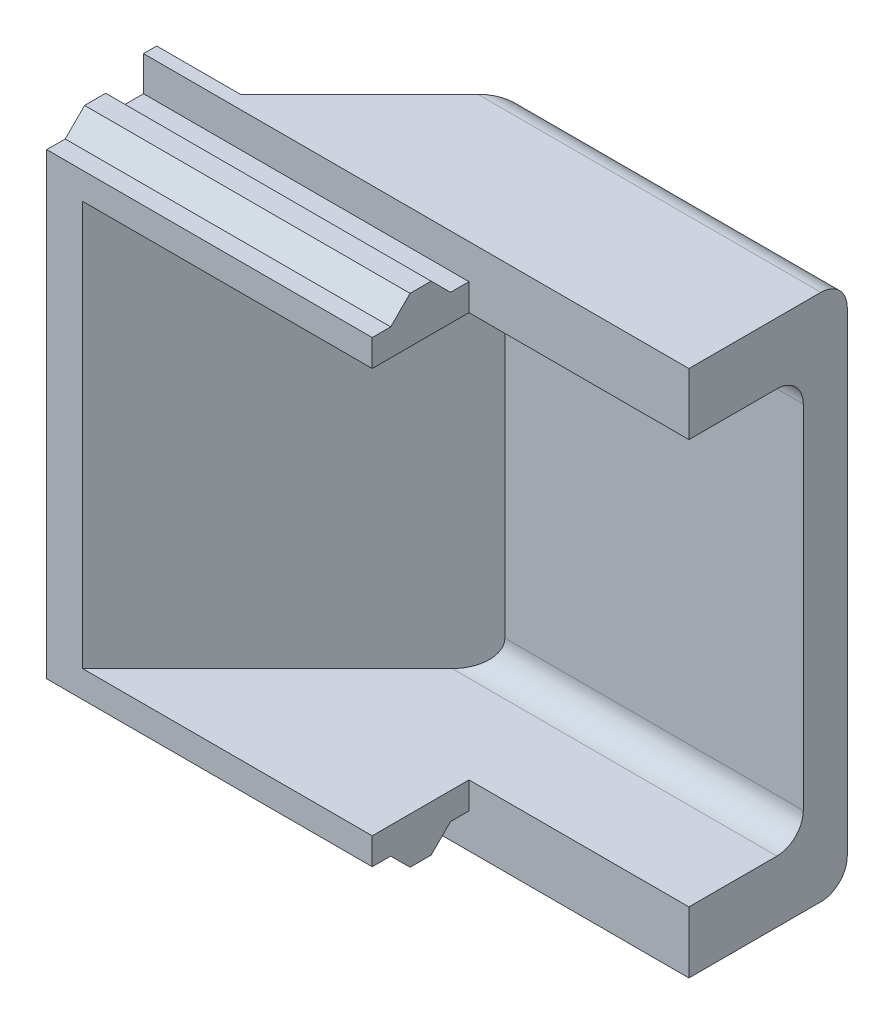
ISO-10303-21;
HEADER;
FILE_DESCRIPTION(('STEP AP214'),'2;1');
FILE_NAME('part.step','',(''),(''),'','','');
FILE_SCHEMA(('AUTOMOTIVE_DESIGN { 1 0 10303 214 1 1 1 1 }'));
ENDSEC;
DATA;
#1=APPLICATION_CONTEXT('core data for automotive mechanical design processes');
#2=APPLICATION_PROTOCOL_DEFINITION('international standard','automotive_design',2000,#1);
#3=PRODUCT_CONTEXT('',#1,'mechanical');
#4=PRODUCT('Part','Part','',(#3));
#5=PRODUCT_RELATED_PRODUCT_CATEGORY('part','',(#4));
#6=PRODUCT_DEFINITION_FORMATION('','',#4);
#7=PRODUCT_DEFINITION_CONTEXT('part definition',#1,'design');
#8=PRODUCT_DEFINITION('design','',#6,#7);
#9=PRODUCT_DEFINITION_SHAPE('','',#8);
#10=(LENGTH_UNIT() NAMED_UNIT(*) SI_UNIT(.MILLI.,.METRE.));
#11=(NAMED_UNIT(*) PLANE_ANGLE_UNIT() SI_UNIT($,.RADIAN.));
#12=(NAMED_UNIT(*) SI_UNIT($,.STERADIAN.) SOLID_ANGLE_UNIT());
#13=UNCERTAINTY_MEASURE_WITH_UNIT(LENGTH_MEASURE(1.E-05),#10,'distance_accuracy_value','');
#14=(GEOMETRIC_REPRESENTATION_CONTEXT(3) GLOBAL_UNCERTAINTY_ASSIGNED_CONTEXT((#13)) GLOBAL_UNIT_ASSIGNED_CONTEXT((#10,
#11,#12)) REPRESENTATION_CONTEXT('',''));
#15=CARTESIAN_POINT('',(0.,0.,0.));
#16=DIRECTION('',(0.,0.,1.));
#17=DIRECTION('',(1.,0.,0.));
#18=AXIS2_PLACEMENT_3D('',#15,#16,#17);
#19=CARTESIAN_POINT('',(9.398,-15.24,0.));
#20=DIRECTION('',(0.,0.,1.));
#21=DIRECTION('',(1.,0.,0.));
#22=AXIS2_PLACEMENT_3D('',#19,#20,#21);
#23=PLANE('',#22);
#24=DIRECTION('',(0.,1.,0.));
#25=VECTOR('',#24,1.);
#26=CARTESIAN_POINT('',(9.398,-15.24,0.));
#27=LINE('',#26,#25);
#28=CARTESIAN_POINT('',(9.398,-14.2367,0.));
#29=VERTEX_POINT('',#28);
#30=CARTESIAN_POINT('',(9.398,-13.462,0.));
#31=VERTEX_POINT('',#30);
#32=EDGE_CURVE('E364',#29,#31,#27,.T.);
#33=ORIENTED_EDGE('',*,*,#32,.T.);
#34=DIRECTION('',(1.,0.,0.));
#35=VECTOR('',#34,1.);
#36=CARTESIAN_POINT('',(1.03405122421385,-13.462,0.));
#37=LINE('',#36,#35);
#38=CARTESIAN_POINT('',(1.03405122421385,-13.462,0.));
#39=VERTEX_POINT('',#38);
#40=EDGE_CURVE('E342',#39,#31,#37,.T.);
#41=ORIENTED_EDGE('',*,*,#40,.F.);
#42=DIRECTION('',(0.,1.,0.));
#43=VECTOR('',#42,1.);
#44=CARTESIAN_POINT('',(1.03405122421385,-13.462,0.));
#45=LINE('',#44,#43);
#46=CARTESIAN_POINT('',(1.03405122421385,-1.778,0.));
#47=VERTEX_POINT('',#46);
#48=EDGE_CURVE('E350',#39,#47,#45,.T.);
#49=ORIENTED_EDGE('',*,*,#48,.T.);
#50=DIRECTION('',(1.,0.,0.));
#51=VECTOR('',#50,1.);
#52=CARTESIAN_POINT('',(1.03405122421385,-1.778,0.));
#53=LINE('',#52,#51);
#54=CARTESIAN_POINT('',(9.398,-1.778,0.));
#55=VERTEX_POINT('',#54);
#56=EDGE_CURVE('E375',#47,#55,#53,.T.);
#57=ORIENTED_EDGE('',*,*,#56,.T.);
#58=CARTESIAN_POINT('',(9.398,-1.0033,0.));
#59=VERTEX_POINT('',#58);
#60=EDGE_CURVE('E457',#55,#59,#27,.T.);
#61=ORIENTED_EDGE('',*,*,#60,.T.);
#62=DIRECTION('',(-1.,0.,0.));
#63=VECTOR('',#62,1.);
#64=CARTESIAN_POINT('',(15.748,-1.0033,0.));
#65=LINE('',#64,#63);
#66=CARTESIAN_POINT('',(0.,-1.0033,0.));
#67=VERTEX_POINT('',#66);
#68=EDGE_CURVE('E430',#59,#67,#65,.T.);
#69=ORIENTED_EDGE('',*,*,#68,.T.);
#70=DIRECTION('',(0.,1.,0.));
#71=VECTOR('',#70,1.);
#72=CARTESIAN_POINT('',(0.,-15.24,0.));
#73=LINE('',#72,#71);
#74=CARTESIAN_POINT('',(0.,-14.2367,0.));
#75=VERTEX_POINT('',#74);
#76=EDGE_CURVE('E469',#75,#67,#73,.T.);
#77=ORIENTED_EDGE('',*,*,#76,.F.);
#78=DIRECTION('',(-1.,0.,0.));
#79=VECTOR('',#78,1.);
#80=CARTESIAN_POINT('',(15.748,-14.2367,0.));
#81=LINE('',#80,#79);
#82=EDGE_CURVE('E399',#29,#75,#81,.T.);
#83=ORIENTED_EDGE('',*,*,#82,.F.);
#84=EDGE_LOOP('',(#33,#41,#49,#57,#61,#69,#77,#83));
#85=FACE_BOUND('',#84,.T.);
#86=ADVANCED_FACE('F149',(#85),#23,.T.);
#87=CARTESIAN_POINT('',(9.398,-15.24,-2.794));
#88=DIRECTION('',(1.,0.,0.));
#89=DIRECTION('',(0.,0.,-1.));
#90=AXIS2_PLACEMENT_3D('',#87,#88,#89);
#91=PLANE('',#90);
#92=DIRECTION('',(0.,1.,0.));
#93=VECTOR('',#92,1.);
#94=CARTESIAN_POINT('',(9.398,-15.24,-2.794));
#95=LINE('',#94,#93);
#96=CARTESIAN_POINT('',(9.398,-14.2367,-2.794));
#97=VERTEX_POINT('',#96);
#98=CARTESIAN_POINT('',(9.398,-13.462,-2.794));
#99=VERTEX_POINT('',#98);
#100=EDGE_CURVE('E486',#97,#99,#95,.T.);
#101=ORIENTED_EDGE('',*,*,#100,.T.);
#102=DIRECTION('',(0.,0.,1.));
#103=VECTOR('',#102,1.);
#104=CARTESIAN_POINT('',(9.398,-13.462,-2.794));
#105=LINE('',#104,#103);
#106=EDGE_CURVE('E379',#99,#31,#105,.T.);
#107=ORIENTED_EDGE('',*,*,#106,.T.);
#108=ORIENTED_EDGE('',*,*,#32,.F.);
#109=DIRECTION('',(0.,0.,-1.));
#110=VECTOR('',#109,1.);
#111=CARTESIAN_POINT('',(9.398,-14.2367,-2.794));
#112=LINE('',#111,#110);
#113=CARTESIAN_POINT('',(9.398,-14.2367,-0.533400000000003));
#114=VERTEX_POINT('',#113);
#115=EDGE_CURVE('E501',#29,#114,#112,.T.);
#116=ORIENTED_EDGE('',*,*,#115,.T.);
#117=DIRECTION('',(0.,-0.707106781186549,-0.707106781186546));
#118=VECTOR('',#117,1.);
#119=CARTESIAN_POINT('',(9.398,-15.86865,-2.16535));
#120=LINE('',#119,#118);
#121=CARTESIAN_POINT('',(9.398,-14.7955,-1.0922));
#122=VERTEX_POINT('',#121);
#123=EDGE_CURVE('E504',#114,#122,#120,.T.);
#124=ORIENTED_EDGE('',*,*,#123,.T.);
#125=DIRECTION('',(0.,0.,-1.));
#126=VECTOR('',#125,1.);
#127=CARTESIAN_POINT('',(9.398,-14.7955,-2.794));
#128=LINE('',#127,#126);
#129=CARTESIAN_POINT('',(9.398,-14.7955,-1.7018));
#130=VERTEX_POINT('',#129);
#131=EDGE_CURVE('E507',#122,#130,#128,.T.);
#132=ORIENTED_EDGE('',*,*,#131,.T.);
#133=DIRECTION('',(0.,0.707106781186549,-0.707106781186546));
#134=VECTOR('',#133,1.);
#135=CARTESIAN_POINT('',(9.398,-14.47165,-2.02565));
#136=LINE('',#135,#134);
#137=CARTESIAN_POINT('',(9.398,-14.2367,-2.2606));
#138=VERTEX_POINT('',#137);
#139=EDGE_CURVE('E510',#130,#138,#136,.T.);
#140=ORIENTED_EDGE('',*,*,#139,.T.);
#141=DIRECTION('',(0.,0.,-1.));
#142=VECTOR('',#141,1.);
#143=CARTESIAN_POINT('',(9.398,-14.2367,-2.794));
#144=LINE('',#143,#142);
#145=EDGE_CURVE('E513',#138,#97,#144,.T.);
#146=ORIENTED_EDGE('',*,*,#145,.T.);
#147=EDGE_LOOP('',(#101,#107,#108,#116,#124,#132,#140,#146));
#148=FACE_BOUND('',#147,.T.);
#149=ADVANCED_FACE('F587',(#148),#91,.T.);
#150=CARTESIAN_POINT('',(15.748,-15.24,-7.366));
#151=DIRECTION('',(1.,0.,0.));
#152=DIRECTION('',(0.,0.,-1.));
#153=AXIS2_PLACEMENT_3D('',#150,#151,#152);
#154=PLANE('',#153);
#155=DIRECTION('',(0.,0.,-1.));
#156=VECTOR('',#155,1.);
#157=CARTESIAN_POINT('',(15.748,-15.24,-7.366));
#158=LINE('',#157,#156);
#159=CARTESIAN_POINT('',(15.748,-15.24,-2.794));
#160=VERTEX_POINT('',#159);
#161=CARTESIAN_POINT('',(15.748,-15.24,-6.604));
#162=VERTEX_POINT('',#161);
#163=EDGE_CURVE('E446',#160,#162,#158,.T.);
#164=ORIENTED_EDGE('',*,*,#163,.T.);
#165=CARTESIAN_POINT('',(15.748,-14.478,-6.604));
#166=DIRECTION('',(1.,0.,0.));
#167=DIRECTION('',(0.,0.,-1.));
#168=AXIS2_PLACEMENT_3D('',#165,#166,#167);
#169=CIRCLE('',#168,0.762);
#170=CARTESIAN_POINT('',(15.748,-14.478,-7.366));
#171=VERTEX_POINT('',#170);
#172=EDGE_CURVE('E544',#162,#171,#169,.T.);
#173=ORIENTED_EDGE('',*,*,#172,.T.);
#174=DIRECTION('',(0.,1.,0.));
#175=VECTOR('',#174,1.);
#176=CARTESIAN_POINT('',(15.748,-15.24,-7.366));
#177=LINE('',#176,#175);
#178=CARTESIAN_POINT('',(15.748,-0.762000000000004,-7.366));
#179=VERTEX_POINT('',#178);
#180=EDGE_CURVE('E480',#171,#179,#177,.T.);
#181=ORIENTED_EDGE('',*,*,#180,.T.);
#182=CARTESIAN_POINT('',(15.748,-0.762,-6.604));
#183=DIRECTION('',(1.,0.,0.));
#184=DIRECTION('',(0.,0.,-1.));
#185=AXIS2_PLACEMENT_3D('',#182,#183,#184);
#186=CIRCLE('',#185,0.762);
#187=CARTESIAN_POINT('',(15.748,0.,-6.604));
#188=VERTEX_POINT('',#187);
#189=EDGE_CURVE('E164',#179,#188,#186,.T.);
#190=ORIENTED_EDGE('',*,*,#189,.T.);
#191=DIRECTION('',(0.,0.,-1.));
#192=VECTOR('',#191,1.);
#193=CARTESIAN_POINT('',(15.748,0.,-7.366));
#194=LINE('',#193,#192);
#195=CARTESIAN_POINT('',(15.748,0.,-2.794));
#196=VERTEX_POINT('',#195);
#197=EDGE_CURVE('E460',#196,#188,#194,.T.);
#198=ORIENTED_EDGE('',*,*,#197,.F.);
#199=DIRECTION('',(0.,1.,0.));
#200=VECTOR('',#199,1.);
#201=CARTESIAN_POINT('',(15.748,-15.24,-2.794));
#202=LINE('',#201,#200);
#203=CARTESIAN_POINT('',(15.748,-1.778,-2.794));
#204=VERTEX_POINT('',#203);
#205=EDGE_CURVE('E485',#204,#196,#202,.T.);
#206=ORIENTED_EDGE('',*,*,#205,.F.);
#207=DIRECTION('',(0.,0.,-1.));
#208=VECTOR('',#207,1.);
#209=CARTESIAN_POINT('',(15.748,-1.778,0.));
#210=LINE('',#209,#208);
#211=CARTESIAN_POINT('',(15.748,-1.778,-5.334));
#212=VERTEX_POINT('',#211);
#213=EDGE_CURVE('E371',#204,#212,#210,.T.);
#214=ORIENTED_EDGE('',*,*,#213,.T.);
#215=CARTESIAN_POINT('',(15.748,-2.54,-5.334));
#216=DIRECTION('',(1.,0.,0.));
#217=DIRECTION('',(0.,0.,-1.));
#218=AXIS2_PLACEMENT_3D('',#215,#216,#217);
#219=CIRCLE('',#218,0.762);
#220=CARTESIAN_POINT('',(15.748,-2.54,-6.096));
#221=VERTEX_POINT('',#220);
#222=EDGE_CURVE('E157',#212,#221,#219,.F.);
#223=ORIENTED_EDGE('',*,*,#222,.T.);
#224=DIRECTION('',(0.,1.,0.));
#225=VECTOR('',#224,1.);
#226=CARTESIAN_POINT('',(15.748,-13.462,-6.096));
#227=LINE('',#226,#225);
#228=CARTESIAN_POINT('',(15.748,-12.7,-6.096));
#229=VERTEX_POINT('',#228);
#230=EDGE_CURVE('E365',#229,#221,#227,.T.);
#231=ORIENTED_EDGE('',*,*,#230,.F.);
#232=CARTESIAN_POINT('',(15.748,-12.7,-5.334));
#233=DIRECTION('',(1.,0.,0.));
#234=DIRECTION('',(0.,0.,-1.));
#235=AXIS2_PLACEMENT_3D('',#232,#233,#234);
#236=CIRCLE('',#235,0.762);
#237=CARTESIAN_POINT('',(15.748,-13.462,-5.334));
#238=VERTEX_POINT('',#237);
#239=EDGE_CURVE('E12',#229,#238,#236,.F.);
#240=ORIENTED_EDGE('',*,*,#239,.T.);
#241=DIRECTION('',(0.,0.,-1.));
#242=VECTOR('',#241,1.);
#243=CARTESIAN_POINT('',(15.748,-13.462,0.));
#244=LINE('',#243,#242);
#245=CARTESIAN_POINT('',(15.748,-13.462,-2.794));
#246=VERTEX_POINT('',#245);
#247=EDGE_CURVE('E347',#246,#238,#244,.T.);
#248=ORIENTED_EDGE('',*,*,#247,.F.);
#249=EDGE_CURVE('E482',#160,#246,#202,.T.);
#250=ORIENTED_EDGE('',*,*,#249,.F.);
#251=EDGE_LOOP('',(#164,#173,#181,#190,#198,#206,#214,#223,#231,#240,#248,#250));
#252=FACE_BOUND('',#251,.T.);
#253=ADVANCED_FACE('F550',(#252),#154,.T.);
#254=CARTESIAN_POINT('',(15.748,-15.24,-2.794));
#255=DIRECTION('',(0.,0.,1.));
#256=DIRECTION('',(1.,0.,0.));
#257=AXIS2_PLACEMENT_3D('',#254,#255,#256);
#258=PLANE('',#257);
#259=ORIENTED_EDGE('',*,*,#249,.T.);
#260=DIRECTION('',(-1.,0.,0.));
#261=VECTOR('',#260,1.);
#262=CARTESIAN_POINT('',(15.748,-13.462,-2.794));
#263=LINE('',#262,#261);
#264=EDGE_CURVE('E518',#246,#99,#263,.T.);
#265=ORIENTED_EDGE('',*,*,#264,.T.);
#266=ORIENTED_EDGE('',*,*,#100,.F.);
#267=DIRECTION('',(-1.,0.,0.));
#268=VECTOR('',#267,1.);
#269=CARTESIAN_POINT('',(15.748,-14.2367,-2.794));
#270=LINE('',#269,#268);
#271=CARTESIAN_POINT('',(0.,-14.2367,-2.794));
#272=VERTEX_POINT('',#271);
#273=EDGE_CURVE('E400',#97,#272,#270,.T.);
#274=ORIENTED_EDGE('',*,*,#273,.T.);
#275=DIRECTION('',(0.,1.,0.));
#276=VECTOR('',#275,1.);
#277=CARTESIAN_POINT('',(0.,-15.24,-2.794));
#278=LINE('',#277,#276);
#279=CARTESIAN_POINT('',(0.,-15.24,-2.794));
#280=VERTEX_POINT('',#279);
#281=EDGE_CURVE('E396',#280,#272,#278,.T.);
#282=ORIENTED_EDGE('',*,*,#281,.F.);
#283=DIRECTION('',(1.,0.,0.));
#284=VECTOR('',#283,1.);
#285=CARTESIAN_POINT('',(15.748,-15.24,-2.794));
#286=LINE('',#285,#284);
#287=EDGE_CURVE('E443',#280,#160,#286,.T.);
#288=ORIENTED_EDGE('',*,*,#287,.T.);
#289=EDGE_LOOP('',(#259,#265,#266,#274,#282,#288));
#290=FACE_BOUND('',#289,.T.);
#291=ADVANCED_FACE('F591',(#290),#258,.T.);
#292=CARTESIAN_POINT('',(0.,-15.24,0.));
#293=DIRECTION('',(-1.,0.,0.));
#294=DIRECTION('',(0.,0.,1.));
#295=AXIS2_PLACEMENT_3D('',#292,#293,#294);
#296=PLANE('',#295);
#297=DIRECTION('',(0.,0.,1.));
#298=VECTOR('',#297,1.);
#299=CARTESIAN_POINT('',(0.,-15.24,0.));
#300=LINE('',#299,#298);
#301=CARTESIAN_POINT('',(0.,-15.24,-3.175));
#302=VERTEX_POINT('',#301);
#303=EDGE_CURVE('E454',#302,#280,#300,.T.);
#304=ORIENTED_EDGE('',*,*,#303,.T.);
#305=ORIENTED_EDGE('',*,*,#281,.T.);
#306=DIRECTION('',(0.,0.,1.));
#307=VECTOR('',#306,1.);
#308=CARTESIAN_POINT('',(0.,-14.2367,-2.794));
#309=LINE('',#308,#307);
#310=CARTESIAN_POINT('',(0.,-14.2367,-2.2606));
#311=VERTEX_POINT('',#310);
#312=EDGE_CURVE('E393',#272,#311,#309,.T.);
#313=ORIENTED_EDGE('',*,*,#312,.T.);
#314=DIRECTION('',(0.,-0.707106781186549,0.707106781186546));
#315=VECTOR('',#314,1.);
#316=CARTESIAN_POINT('',(0.,-14.7955,-1.7018));
#317=LINE('',#316,#315);
#318=CARTESIAN_POINT('',(0.,-14.7955,-1.7018));
#319=VERTEX_POINT('',#318);
#320=EDGE_CURVE('E390',#311,#319,#317,.T.);
#321=ORIENTED_EDGE('',*,*,#320,.T.);
#322=DIRECTION('',(0.,0.,1.));
#323=VECTOR('',#322,1.);
#324=CARTESIAN_POINT('',(0.,-14.7955,-1.0922));
#325=LINE('',#324,#323);
#326=CARTESIAN_POINT('',(0.,-14.7955,-1.0922));
#327=VERTEX_POINT('',#326);
#328=EDGE_CURVE('E387',#319,#327,#325,.T.);
#329=ORIENTED_EDGE('',*,*,#328,.T.);
#330=DIRECTION('',(0.,0.707106781186549,0.707106781186546));
#331=VECTOR('',#330,1.);
#332=CARTESIAN_POINT('',(0.,-14.2367,-0.533400000000003));
#333=LINE('',#332,#331);
#334=CARTESIAN_POINT('',(0.,-14.2367,-0.533400000000003));
#335=VERTEX_POINT('',#334);
#336=EDGE_CURVE('E384',#327,#335,#333,.T.);
#337=ORIENTED_EDGE('',*,*,#336,.T.);
#338=DIRECTION('',(0.,0.,1.));
#339=VECTOR('',#338,1.);
#340=CARTESIAN_POINT('',(0.,-14.2367,-0.533400000000003));
#341=LINE('',#340,#339);
#342=EDGE_CURVE('E381',#335,#75,#341,.T.);
#343=ORIENTED_EDGE('',*,*,#342,.T.);
#344=ORIENTED_EDGE('',*,*,#76,.T.);
#345=DIRECTION('',(0.,0.,1.));
#346=VECTOR('',#345,1.);
#347=CARTESIAN_POINT('',(0.,-1.0033,-0.533400000000003));
#348=LINE('',#347,#346);
#349=CARTESIAN_POINT('',(0.,-1.0033,-0.533400000000003));
#350=VERTEX_POINT('',#349);
#351=EDGE_CURVE('E426',#350,#67,#348,.T.);
#352=ORIENTED_EDGE('',*,*,#351,.F.);
#353=DIRECTION('',(0.,-0.707106781186549,0.707106781186546));
#354=VECTOR('',#353,1.);
#355=CARTESIAN_POINT('',(0.,-1.0033,-0.533400000000003));
#356=LINE('',#355,#354);
#357=CARTESIAN_POINT('',(0.,-0.4445,-1.0922));
#358=VERTEX_POINT('',#357);
#359=EDGE_CURVE('E423',#358,#350,#356,.T.);
#360=ORIENTED_EDGE('',*,*,#359,.F.);
#361=DIRECTION('',(0.,0.,1.));
#362=VECTOR('',#361,1.);
#363=CARTESIAN_POINT('',(0.,-0.4445,-1.0922));
#364=LINE('',#363,#362);
#365=CARTESIAN_POINT('',(0.,-0.444500000000001,-1.7018));
#366=VERTEX_POINT('',#365);
#367=EDGE_CURVE('E420',#366,#358,#364,.T.);
#368=ORIENTED_EDGE('',*,*,#367,.F.);
#369=DIRECTION('',(0.,0.707106781186549,0.707106781186546));
#370=VECTOR('',#369,1.);
#371=CARTESIAN_POINT('',(0.,-0.444500000000001,-1.7018));
#372=LINE('',#371,#370);
#373=CARTESIAN_POINT('',(0.,-1.0033,-2.2606));
#374=VERTEX_POINT('',#373);
#375=EDGE_CURVE('E417',#374,#366,#372,.T.);
#376=ORIENTED_EDGE('',*,*,#375,.F.);
#377=DIRECTION('',(0.,0.,1.));
#378=VECTOR('',#377,1.);
#379=CARTESIAN_POINT('',(0.,-1.0033,-2.794));
#380=LINE('',#379,#378);
#381=CARTESIAN_POINT('',(0.,-1.0033,-2.794));
#382=VERTEX_POINT('',#381);
#383=EDGE_CURVE('E414',#382,#374,#380,.T.);
#384=ORIENTED_EDGE('',*,*,#383,.F.);
#385=DIRECTION('',(0.,-1.,0.));
#386=VECTOR('',#385,1.);
#387=CARTESIAN_POINT('',(0.,0.,-2.794));
#388=LINE('',#387,#386);
#389=CARTESIAN_POINT('',(0.,0.,-2.794));
#390=VERTEX_POINT('',#389);
#391=EDGE_CURVE('E402',#390,#382,#388,.T.);
#392=ORIENTED_EDGE('',*,*,#391,.F.);
#393=DIRECTION('',(0.,0.,1.));
#394=VECTOR('',#393,1.);
#395=CARTESIAN_POINT('',(0.,0.,0.));
#396=LINE('',#395,#394);
#397=CARTESIAN_POINT('',(0.,0.,-3.175));
#398=VERTEX_POINT('',#397);
#399=EDGE_CURVE('E447',#398,#390,#396,.T.);
#400=ORIENTED_EDGE('',*,*,#399,.F.);
#401=DIRECTION('',(0.,1.,0.));
#402=VECTOR('',#401,1.);
#403=CARTESIAN_POINT('',(0.,-15.24,-3.175));
#404=LINE('',#403,#402);
#405=EDGE_CURVE('E472',#302,#398,#404,.T.);
#406=ORIENTED_EDGE('',*,*,#405,.F.);
#407=EDGE_LOOP('',(#304,#305,#313,#321,#329,#337,#343,#344,#352,#360,#368,#376,#384,#392,#400,#406));
#408=FACE_BOUND('',#407,.T.);
#409=ADVANCED_FACE('F582',(#408),#296,.T.);
#410=DIRECTION('',(0.,0.,1.));
#411=VECTOR('',#410,1.);
#412=CARTESIAN_POINT('',(9.398,-1.778,-2.794));
#413=LINE('',#412,#411);
#414=CARTESIAN_POINT('',(9.398,-1.778,-2.794));
#415=VERTEX_POINT('',#414);
#416=EDGE_CURVE('E358',#415,#55,#413,.T.);
#417=ORIENTED_EDGE('',*,*,#416,.F.);
#418=CARTESIAN_POINT('',(9.398,-1.0033,-2.794));
#419=VERTEX_POINT('',#418);
#420=EDGE_CURVE('E489',#415,#419,#95,.T.);
#421=ORIENTED_EDGE('',*,*,#420,.T.);
#422=DIRECTION('',(0.,0.,-1.));
#423=VECTOR('',#422,1.);
#424=CARTESIAN_POINT('',(9.398,-1.0033,-2.794));
#425=LINE('',#424,#423);
#426=CARTESIAN_POINT('',(9.398,-1.0033,-2.2606));
#427=VERTEX_POINT('',#426);
#428=EDGE_CURVE('E471',#427,#419,#425,.T.);
#429=ORIENTED_EDGE('',*,*,#428,.F.);
#430=DIRECTION('',(0.,-0.707106781186549,-0.707106781186546));
#431=VECTOR('',#430,1.);
#432=CARTESIAN_POINT('',(9.398,-8.38835000000003,-9.64565));
#433=LINE('',#432,#431);
#434=CARTESIAN_POINT('',(9.398,-0.444500000000001,-1.7018));
#435=VERTEX_POINT('',#434);
#436=EDGE_CURVE('E493',#435,#427,#433,.T.);
#437=ORIENTED_EDGE('',*,*,#436,.F.);
#438=DIRECTION('',(0.,0.,-1.));
#439=VECTOR('',#438,1.);
#440=CARTESIAN_POINT('',(9.398,-0.4445,-2.794));
#441=LINE('',#440,#439);
#442=CARTESIAN_POINT('',(9.398,-0.4445,-1.0922));
#443=VERTEX_POINT('',#442);
#444=EDGE_CURVE('E495',#443,#435,#441,.T.);
#445=ORIENTED_EDGE('',*,*,#444,.F.);
#446=DIRECTION('',(0.,0.707106781186549,-0.707106781186546));
#447=VECTOR('',#446,1.);
#448=CARTESIAN_POINT('',(9.398,-6.99135000000002,5.45465));
#449=LINE('',#448,#447);
#450=CARTESIAN_POINT('',(9.398,-1.0033,-0.533400000000003));
#451=VERTEX_POINT('',#450);
#452=EDGE_CURVE('E497',#451,#443,#449,.T.);
#453=ORIENTED_EDGE('',*,*,#452,.F.);
#454=DIRECTION('',(0.,0.,-1.));
#455=VECTOR('',#454,1.);
#456=CARTESIAN_POINT('',(9.398,-1.0033,-2.79400000000001));
#457=LINE('',#456,#455);
#458=EDGE_CURVE('E499',#59,#451,#457,.T.);
#459=ORIENTED_EDGE('',*,*,#458,.F.);
#460=ORIENTED_EDGE('',*,*,#60,.F.);
#461=EDGE_LOOP('',(#417,#421,#429,#437,#445,#453,#459,#460));
#462=FACE_BOUND('',#461,.T.);
#463=ADVANCED_FACE('F568',(#462),#91,.T.);
#464=CARTESIAN_POINT('',(0.,-15.24,0.));
#465=DIRECTION('',(0.,-1.,0.));
#466=DIRECTION('',(0.,0.,-1.));
#467=AXIS2_PLACEMENT_3D('',#464,#465,#466);
#468=PLANE('',#467);
#469=DIRECTION('',(-0.707106781186546,0.,0.707106781186549));
#470=VECTOR('',#469,1.);
#471=CARTESIAN_POINT('',(2.41300000000002,-15.24,-3.175));
#472=LINE('',#471,#470);
#473=CARTESIAN_POINT('',(5.842,-15.24,-6.604));
#474=VERTEX_POINT('',#473);
#475=CARTESIAN_POINT('',(2.41300000000002,-15.24,-3.175));
#476=VERTEX_POINT('',#475);
#477=EDGE_CURVE('E449',#474,#476,#472,.T.);
#478=ORIENTED_EDGE('',*,*,#477,.F.);
#479=DIRECTION('',(-1.,0.,0.));
#480=VECTOR('',#479,1.);
#481=CARTESIAN_POINT('',(0.,-15.24,-6.604));
#482=LINE('',#481,#480);
#483=EDGE_CURVE('E172',#474,#162,#482,.F.);
#484=ORIENTED_EDGE('',*,*,#483,.T.);
#485=ORIENTED_EDGE('',*,*,#163,.F.);
#486=ORIENTED_EDGE('',*,*,#287,.F.);
#487=ORIENTED_EDGE('',*,*,#303,.F.);
#488=DIRECTION('',(-1.,0.,0.));
#489=VECTOR('',#488,1.);
#490=CARTESIAN_POINT('',(0.,-15.24,-3.175));
#491=LINE('',#490,#489);
#492=EDGE_CURVE('E451',#476,#302,#491,.T.);
#493=ORIENTED_EDGE('',*,*,#492,.F.);
#494=EDGE_LOOP('',(#478,#484,#485,#486,#487,#493));
#495=FACE_BOUND('',#494,.T.);
#496=ADVANCED_FACE('F594',(#495),#468,.T.);
#497=CARTESIAN_POINT('',(0.,-15.24,-3.175));
#498=DIRECTION('',(0.,0.,-1.));
#499=DIRECTION('',(-1.,0.,0.));
#500=AXIS2_PLACEMENT_3D('',#497,#498,#499);
#501=PLANE('',#500);
#502=DIRECTION('',(-1.,0.,0.));
#503=VECTOR('',#502,1.);
#504=CARTESIAN_POINT('',(0.,0.,-3.175));
#505=LINE('',#504,#503);
#506=CARTESIAN_POINT('',(2.41300000000002,0.,-3.175));
#507=VERTEX_POINT('',#506);
#508=EDGE_CURVE('E464',#507,#398,#505,.T.);
#509=ORIENTED_EDGE('',*,*,#508,.F.);
#510=DIRECTION('',(0.,1.,0.));
#511=VECTOR('',#510,1.);
#512=CARTESIAN_POINT('',(2.41300000000002,-15.24,-3.175));
#513=LINE('',#512,#511);
#514=EDGE_CURVE('E474',#476,#507,#513,.T.);
#515=ORIENTED_EDGE('',*,*,#514,.F.);
#516=ORIENTED_EDGE('',*,*,#492,.T.);
#517=ORIENTED_EDGE('',*,*,#405,.T.);
#518=EDGE_LOOP('',(#509,#515,#516,#517));
#519=FACE_BOUND('',#518,.T.);
#520=ADVANCED_FACE('F603',(#519),#501,.T.);
#521=CARTESIAN_POINT('',(2.41300000000002,-15.24,-3.175));
#522=DIRECTION('',(-0.707106781186549,0.,-0.707106781186546));
#523=DIRECTION('',(-0.707106781186546,0.,0.707106781186549));
#524=AXIS2_PLACEMENT_3D('',#521,#522,#523);
#525=PLANE('',#524);
#526=DIRECTION('',(0.,1.,0.));
#527=VECTOR('',#526,1.);
#528=CARTESIAN_POINT('',(6.604,-15.24,-7.366));
#529=LINE('',#528,#527);
#530=CARTESIAN_POINT('',(6.604,-14.478,-7.366));
#531=VERTEX_POINT('',#530);
#532=CARTESIAN_POINT('',(6.604,-0.762000000000004,-7.366));
#533=VERTEX_POINT('',#532);
#534=EDGE_CURVE('E477',#531,#533,#529,.T.);
#535=ORIENTED_EDGE('',*,*,#534,.F.);
#536=CARTESIAN_POINT('',(5.842,-14.478,-6.604));
#537=DIRECTION('',(-0.707106781186549,0.,-0.707106781186546));
#538=DIRECTION('',(-0.707106781186546,0.,0.707106781186549));
#539=AXIS2_PLACEMENT_3D('',#536,#537,#538);
#540=ELLIPSE('',#539,1.0776307345283,0.762);
#541=EDGE_CURVE('E540',#531,#474,#540,.T.);
#542=ORIENTED_EDGE('',*,*,#541,.T.);
#543=ORIENTED_EDGE('',*,*,#477,.T.);
#544=ORIENTED_EDGE('',*,*,#514,.T.);
#545=DIRECTION('',(-0.707106781186546,0.,0.707106781186549));
#546=VECTOR('',#545,1.);
#547=CARTESIAN_POINT('',(2.41300000000002,0.,-3.175));
#548=LINE('',#547,#546);
#549=CARTESIAN_POINT('',(5.842,0.,-6.604));
#550=VERTEX_POINT('',#549);
#551=EDGE_CURVE('E462',#550,#507,#548,.T.);
#552=ORIENTED_EDGE('',*,*,#551,.F.);
#553=CARTESIAN_POINT('',(5.842,-0.762,-6.604));
#554=DIRECTION('',(-0.707106781186549,0.,-0.707106781186546));
#555=DIRECTION('',(0.707106781186546,0.,-0.707106781186549));
#556=AXIS2_PLACEMENT_3D('',#553,#554,#555);
#557=ELLIPSE('',#556,1.0776307345283,0.762);
#558=EDGE_CURVE('E538',#550,#533,#557,.T.);
#559=ORIENTED_EDGE('',*,*,#558,.T.);
#560=EDGE_LOOP('',(#535,#542,#543,#544,#552,#559));
#561=FACE_BOUND('',#560,.T.);
#562=ADVANCED_FACE('F618',(#561),#525,.T.);
#563=CARTESIAN_POINT('',(6.604,-15.24,-7.366));
#564=DIRECTION('',(0.,0.,-1.));
#565=DIRECTION('',(-1.,0.,0.));
#566=AXIS2_PLACEMENT_3D('',#563,#564,#565);
#567=PLANE('',#566);
#568=ORIENTED_EDGE('',*,*,#180,.F.);
#569=DIRECTION('',(-1.,0.,0.));
#570=VECTOR('',#569,1.);
#571=CARTESIAN_POINT('',(6.604,-14.478,-7.366));
#572=LINE('',#571,#570);
#573=EDGE_CURVE('E535',#171,#531,#572,.T.);
#574=ORIENTED_EDGE('',*,*,#573,.T.);
#575=ORIENTED_EDGE('',*,*,#534,.T.);
#576=DIRECTION('',(-1.,0.,0.));
#577=VECTOR('',#576,1.);
#578=CARTESIAN_POINT('',(15.748,-0.762,-7.366));
#579=LINE('',#578,#577);
#580=EDGE_CURVE('E533',#533,#179,#579,.F.);
#581=ORIENTED_EDGE('',*,*,#580,.T.);
#582=EDGE_LOOP('',(#568,#574,#575,#581));
#583=FACE_BOUND('',#582,.T.);
#584=ADVANCED_FACE('F610',(#583),#567,.T.);
#585=DIRECTION('',(-1.,0.,0.));
#586=VECTOR('',#585,1.);
#587=CARTESIAN_POINT('',(15.748,-1.778,-2.794));
#588=LINE('',#587,#586);
#589=EDGE_CURVE('E516',#204,#415,#588,.T.);
#590=ORIENTED_EDGE('',*,*,#589,.F.);
#591=ORIENTED_EDGE('',*,*,#205,.T.);
#592=DIRECTION('',(1.,0.,0.));
#593=VECTOR('',#592,1.);
#594=CARTESIAN_POINT('',(15.748,0.,-2.794));
#595=LINE('',#594,#593);
#596=EDGE_CURVE('E433',#390,#196,#595,.T.);
#597=ORIENTED_EDGE('',*,*,#596,.F.);
#598=ORIENTED_EDGE('',*,*,#391,.T.);
#599=DIRECTION('',(-1.,0.,0.));
#600=VECTOR('',#599,1.);
#601=CARTESIAN_POINT('',(15.748,-1.0033,-2.794));
#602=LINE('',#601,#600);
#603=EDGE_CURVE('E429',#419,#382,#602,.T.);
#604=ORIENTED_EDGE('',*,*,#603,.F.);
#605=ORIENTED_EDGE('',*,*,#420,.F.);
#606=EDGE_LOOP('',(#590,#591,#597,#598,#604,#605));
#607=FACE_BOUND('',#606,.T.);
#608=ADVANCED_FACE('F621',(#607),#258,.T.);
#609=CARTESIAN_POINT('',(0.,0.,0.));
#610=DIRECTION('',(0.,-1.,0.));
#611=DIRECTION('',(0.,0.,-1.));
#612=AXIS2_PLACEMENT_3D('',#609,#610,#611);
#613=PLANE('',#612);
#614=ORIENTED_EDGE('',*,*,#197,.T.);
#615=DIRECTION('',(-1.,0.,0.));
#616=VECTOR('',#615,1.);
#617=CARTESIAN_POINT('',(6.604,0.,-6.604));
#618=LINE('',#617,#616);
#619=EDGE_CURVE('E546',#188,#550,#618,.T.);
#620=ORIENTED_EDGE('',*,*,#619,.T.);
#621=ORIENTED_EDGE('',*,*,#551,.T.);
#622=ORIENTED_EDGE('',*,*,#508,.T.);
#623=ORIENTED_EDGE('',*,*,#399,.T.);
#624=ORIENTED_EDGE('',*,*,#596,.T.);
#625=EDGE_LOOP('',(#614,#620,#621,#622,#623,#624));
#626=FACE_BOUND('',#625,.T.);
#627=ADVANCED_FACE('F617',(#626),#613,.F.);
#628=CARTESIAN_POINT('',(15.748,-1.0033,-0.533400000000003));
#629=DIRECTION('',(0.,-1.,0.));
#630=DIRECTION('',(0.,0.,-1.));
#631=AXIS2_PLACEMENT_3D('',#628,#629,#630);
#632=PLANE('',#631);
#633=ORIENTED_EDGE('',*,*,#458,.T.);
#634=DIRECTION('',(-1.,0.,0.));
#635=VECTOR('',#634,1.);
#636=CARTESIAN_POINT('',(15.748,-1.0033,-0.533400000000003));
#637=LINE('',#636,#635);
#638=EDGE_CURVE('E434',#451,#350,#637,.T.);
#639=ORIENTED_EDGE('',*,*,#638,.T.);
#640=ORIENTED_EDGE('',*,*,#351,.T.);
#641=ORIENTED_EDGE('',*,*,#68,.F.);
#642=EDGE_LOOP('',(#633,#639,#640,#641));
#643=FACE_BOUND('',#642,.T.);
#644=ADVANCED_FACE('F574',(#643),#632,.F.);
#645=CARTESIAN_POINT('',(15.748,-1.0033,-0.533400000000003));
#646=DIRECTION('',(0.,-0.707106781186546,-0.707106781186549));
#647=DIRECTION('',(0.,0.707106781186549,-0.707106781186546));
#648=AXIS2_PLACEMENT_3D('',#645,#646,#647);
#649=PLANE('',#648);
#650=ORIENTED_EDGE('',*,*,#452,.T.);
#651=DIRECTION('',(-1.,0.,0.));
#652=VECTOR('',#651,1.);
#653=CARTESIAN_POINT('',(15.748,-0.4445,-1.0922));
#654=LINE('',#653,#652);
#655=EDGE_CURVE('E436',#443,#358,#654,.T.);
#656=ORIENTED_EDGE('',*,*,#655,.T.);
#657=ORIENTED_EDGE('',*,*,#359,.T.);
#658=ORIENTED_EDGE('',*,*,#638,.F.);
#659=EDGE_LOOP('',(#650,#656,#657,#658));
#660=FACE_BOUND('',#659,.T.);
#661=ADVANCED_FACE('F576',(#660),#649,.F.);
#662=CARTESIAN_POINT('',(15.748,-0.4445,-1.0922));
#663=DIRECTION('',(0.,-1.,0.));
#664=DIRECTION('',(0.,0.,-1.));
#665=AXIS2_PLACEMENT_3D('',#662,#663,#664);
#666=PLANE('',#665);
#667=ORIENTED_EDGE('',*,*,#444,.T.);
#668=DIRECTION('',(-1.,0.,0.));
#669=VECTOR('',#668,1.);
#670=CARTESIAN_POINT('',(15.748,-0.444500000000001,-1.7018));
#671=LINE('',#670,#669);
#672=EDGE_CURVE('E438',#435,#366,#671,.T.);
#673=ORIENTED_EDGE('',*,*,#672,.T.);
#674=ORIENTED_EDGE('',*,*,#367,.T.);
#675=ORIENTED_EDGE('',*,*,#655,.F.);
#676=EDGE_LOOP('',(#667,#673,#674,#675));
#677=FACE_BOUND('',#676,.T.);
#678=ADVANCED_FACE('F634',(#677),#666,.F.);
#679=CARTESIAN_POINT('',(15.748,-0.444500000000001,-1.7018));
#680=DIRECTION('',(0.,-0.707106781186546,0.707106781186549));
#681=DIRECTION('',(0.,-0.707106781186549,-0.707106781186546));
#682=AXIS2_PLACEMENT_3D('',#679,#680,#681);
#683=PLANE('',#682);
#684=ORIENTED_EDGE('',*,*,#436,.T.);
#685=DIRECTION('',(-1.,0.,0.));
#686=VECTOR('',#685,1.);
#687=CARTESIAN_POINT('',(15.748,-1.0033,-2.2606));
#688=LINE('',#687,#686);
#689=EDGE_CURVE('E440',#427,#374,#688,.T.);
#690=ORIENTED_EDGE('',*,*,#689,.T.);
#691=ORIENTED_EDGE('',*,*,#375,.T.);
#692=ORIENTED_EDGE('',*,*,#672,.F.);
#693=EDGE_LOOP('',(#684,#690,#691,#692));
#694=FACE_BOUND('',#693,.T.);
#695=ADVANCED_FACE('F632',(#694),#683,.F.);
#696=CARTESIAN_POINT('',(15.748,-1.0033,-2.794));
#697=DIRECTION('',(0.,-1.,0.));
#698=DIRECTION('',(0.,0.,-1.));
#699=AXIS2_PLACEMENT_3D('',#696,#697,#698);
#700=PLANE('',#699);
#701=ORIENTED_EDGE('',*,*,#428,.T.);
#702=ORIENTED_EDGE('',*,*,#603,.T.);
#703=ORIENTED_EDGE('',*,*,#383,.T.);
#704=ORIENTED_EDGE('',*,*,#689,.F.);
#705=EDGE_LOOP('',(#701,#702,#703,#704));
#706=FACE_BOUND('',#705,.T.);
#707=ADVANCED_FACE('F627',(#706),#700,.F.);
#708=CARTESIAN_POINT('',(15.748,-14.2367,-2.794));
#709=DIRECTION('',(0.,-1.,0.));
#710=DIRECTION('',(0.,0.,-1.));
#711=AXIS2_PLACEMENT_3D('',#708,#709,#710);
#712=PLANE('',#711);
#713=DIRECTION('',(-1.,0.,0.));
#714=VECTOR('',#713,1.);
#715=CARTESIAN_POINT('',(15.748,-14.2367,-2.2606));
#716=LINE('',#715,#714);
#717=EDGE_CURVE('E403',#138,#311,#716,.T.);
#718=ORIENTED_EDGE('',*,*,#717,.T.);
#719=ORIENTED_EDGE('',*,*,#312,.F.);
#720=ORIENTED_EDGE('',*,*,#273,.F.);
#721=ORIENTED_EDGE('',*,*,#145,.F.);
#722=EDGE_LOOP('',(#718,#719,#720,#721));
#723=FACE_BOUND('',#722,.T.);
#724=ADVANCED_FACE('F831',(#723),#712,.T.);
#725=CARTESIAN_POINT('',(15.748,-14.7955,-1.7018));
#726=DIRECTION('',(0.,-0.707106781186546,-0.707106781186549));
#727=DIRECTION('',(0.,0.707106781186549,-0.707106781186546));
#728=AXIS2_PLACEMENT_3D('',#725,#726,#727);
#729=PLANE('',#728);
#730=DIRECTION('',(-1.,0.,0.));
#731=VECTOR('',#730,1.);
#732=CARTESIAN_POINT('',(15.748,-14.7955,-1.7018));
#733=LINE('',#732,#731);
#734=EDGE_CURVE('E405',#130,#319,#733,.T.);
#735=ORIENTED_EDGE('',*,*,#734,.T.);
#736=ORIENTED_EDGE('',*,*,#320,.F.);
#737=ORIENTED_EDGE('',*,*,#717,.F.);
#738=ORIENTED_EDGE('',*,*,#139,.F.);
#739=EDGE_LOOP('',(#735,#736,#737,#738));
#740=FACE_BOUND('',#739,.T.);
#741=ADVANCED_FACE('F821',(#740),#729,.T.);
#742=CARTESIAN_POINT('',(15.748,-14.7955,-1.0922));
#743=DIRECTION('',(0.,-1.,0.));
#744=DIRECTION('',(0.,0.,-1.));
#745=AXIS2_PLACEMENT_3D('',#742,#743,#744);
#746=PLANE('',#745);
#747=DIRECTION('',(-1.,0.,0.));
#748=VECTOR('',#747,1.);
#749=CARTESIAN_POINT('',(15.748,-14.7955,-1.0922));
#750=LINE('',#749,#748);
#751=EDGE_CURVE('E407',#122,#327,#750,.T.);
#752=ORIENTED_EDGE('',*,*,#751,.T.);
#753=ORIENTED_EDGE('',*,*,#328,.F.);
#754=ORIENTED_EDGE('',*,*,#734,.F.);
#755=ORIENTED_EDGE('',*,*,#131,.F.);
#756=EDGE_LOOP('',(#752,#753,#754,#755));
#757=FACE_BOUND('',#756,.T.);
#758=ADVANCED_FACE('F811',(#757),#746,.T.);
#759=CARTESIAN_POINT('',(15.748,-14.2367,-0.533400000000003));
#760=DIRECTION('',(0.,-0.707106781186546,0.707106781186549));
#761=DIRECTION('',(0.,-0.707106781186549,-0.707106781186546));
#762=AXIS2_PLACEMENT_3D('',#759,#760,#761);
#763=PLANE('',#762);
#764=DIRECTION('',(-1.,0.,0.));
#765=VECTOR('',#764,1.);
#766=CARTESIAN_POINT('',(15.748,-14.2367,-0.533400000000003));
#767=LINE('',#766,#765);
#768=EDGE_CURVE('E409',#114,#335,#767,.T.);
#769=ORIENTED_EDGE('',*,*,#768,.T.);
#770=ORIENTED_EDGE('',*,*,#336,.F.);
#771=ORIENTED_EDGE('',*,*,#751,.F.);
#772=ORIENTED_EDGE('',*,*,#123,.F.);
#773=EDGE_LOOP('',(#769,#770,#771,#772));
#774=FACE_BOUND('',#773,.T.);
#775=ADVANCED_FACE('F801',(#774),#763,.T.);
#776=CARTESIAN_POINT('',(15.748,-14.2367,-0.533400000000003));
#777=DIRECTION('',(0.,-1.,0.));
#778=DIRECTION('',(0.,0.,-1.));
#779=AXIS2_PLACEMENT_3D('',#776,#777,#778);
#780=PLANE('',#779);
#781=ORIENTED_EDGE('',*,*,#82,.T.);
#782=ORIENTED_EDGE('',*,*,#342,.F.);
#783=ORIENTED_EDGE('',*,*,#768,.F.);
#784=ORIENTED_EDGE('',*,*,#115,.F.);
#785=EDGE_LOOP('',(#781,#782,#783,#784));
#786=FACE_BOUND('',#785,.T.);
#787=ADVANCED_FACE('F711',(#786),#780,.T.);
#788=CARTESIAN_POINT('',(7.13005122421384,-13.462,-6.096));
#789=DIRECTION('',(-0.707106781186548,0.,-0.707106781186547));
#790=DIRECTION('',(-0.707106781186547,0.,0.707106781186548));
#791=AXIS2_PLACEMENT_3D('',#788,#789,#790);
#792=PLANE('',#791);
#793=DIRECTION('',(0.,1.,0.));
#794=VECTOR('',#793,1.);
#795=CARTESIAN_POINT('',(7.13005122421384,-13.462,-6.096));
#796=LINE('',#795,#794);
#797=CARTESIAN_POINT('',(7.13005122421384,-12.7,-6.096));
#798=VERTEX_POINT('',#797);
#799=CARTESIAN_POINT('',(7.13005122421384,-2.54,-6.096));
#800=VERTEX_POINT('',#799);
#801=EDGE_CURVE('E359',#798,#800,#796,.T.);
#802=ORIENTED_EDGE('',*,*,#801,.T.);
#803=CARTESIAN_POINT('',(6.36805122421384,-2.54,-5.334));
#804=DIRECTION('',(-0.707106781186548,0.,-0.707106781186547));
#805=DIRECTION('',(0.707106781186547,0.,-0.707106781186548));
#806=AXIS2_PLACEMENT_3D('',#803,#804,#805);
#807=ELLIPSE('',#806,1.0776307345283,0.762);
#808=CARTESIAN_POINT('',(6.36805122421384,-1.778,-5.334));
#809=VERTEX_POINT('',#808);
#810=EDGE_CURVE('E528',#800,#809,#807,.F.);
#811=ORIENTED_EDGE('',*,*,#810,.T.);
#812=DIRECTION('',(-0.707106781186547,0.,0.707106781186548));
#813=VECTOR('',#812,1.);
#814=CARTESIAN_POINT('',(7.13005122421384,-1.778,-6.096));
#815=LINE('',#814,#813);
#816=EDGE_CURVE('E354',#809,#47,#815,.T.);
#817=ORIENTED_EDGE('',*,*,#816,.T.);
#818=ORIENTED_EDGE('',*,*,#48,.F.);
#819=DIRECTION('',(-0.707106781186547,0.,0.707106781186548));
#820=VECTOR('',#819,1.);
#821=CARTESIAN_POINT('',(7.13005122421384,-13.462,-6.096));
#822=LINE('',#821,#820);
#823=CARTESIAN_POINT('',(6.36805122421384,-13.462,-5.334));
#824=VERTEX_POINT('',#823);
#825=EDGE_CURVE('E337',#824,#39,#822,.T.);
#826=ORIENTED_EDGE('',*,*,#825,.F.);
#827=CARTESIAN_POINT('',(6.36805122421385,-12.7,-5.334));
#828=DIRECTION('',(-0.707106781186548,0.,-0.707106781186547));
#829=DIRECTION('',(-0.707106781186547,0.,0.707106781186548));
#830=AXIS2_PLACEMENT_3D('',#827,#828,#829);
#831=ELLIPSE('',#830,1.0776307345283,0.762);
#832=EDGE_CURVE('E526',#824,#798,#831,.F.);
#833=ORIENTED_EDGE('',*,*,#832,.T.);
#834=EDGE_LOOP('',(#802,#811,#817,#818,#826,#833));
#835=FACE_BOUND('',#834,.T.);
#836=ADVANCED_FACE('F352',(#835),#792,.F.);
#837=CARTESIAN_POINT('',(15.748,-13.462,-6.096));
#838=DIRECTION('',(0.,0.,-1.));
#839=DIRECTION('',(-1.,0.,0.));
#840=AXIS2_PLACEMENT_3D('',#837,#838,#839);
#841=PLANE('',#840);
#842=ORIENTED_EDGE('',*,*,#230,.T.);
#843=DIRECTION('',(-1.,0.,0.));
#844=VECTOR('',#843,1.);
#845=CARTESIAN_POINT('',(7.13005122421384,-2.54,-6.096));
#846=LINE('',#845,#844);
#847=EDGE_CURVE('E523',#221,#800,#846,.T.);
#848=ORIENTED_EDGE('',*,*,#847,.T.);
#849=ORIENTED_EDGE('',*,*,#801,.F.);
#850=DIRECTION('',(-1.,0.,0.));
#851=VECTOR('',#850,1.);
#852=CARTESIAN_POINT('',(15.748,-12.7,-6.096));
#853=LINE('',#852,#851);
#854=EDGE_CURVE('E521',#798,#229,#853,.F.);
#855=ORIENTED_EDGE('',*,*,#854,.T.);
#856=EDGE_LOOP('',(#842,#848,#849,#855));
#857=FACE_BOUND('',#856,.T.);
#858=ADVANCED_FACE('F557',(#857),#841,.F.);
#859=CARTESIAN_POINT('',(0.,-13.462,0.));
#860=DIRECTION('',(0.,1.,0.));
#861=DIRECTION('',(0.,0.,1.));
#862=AXIS2_PLACEMENT_3D('',#859,#860,#861);
#863=PLANE('',#862);
#864=ORIENTED_EDGE('',*,*,#247,.T.);
#865=DIRECTION('',(-1.,0.,0.));
#866=VECTOR('',#865,1.);
#867=CARTESIAN_POINT('',(0.,-13.462,-5.334));
#868=LINE('',#867,#866);
#869=EDGE_CURVE('E345',#238,#824,#868,.T.);
#870=ORIENTED_EDGE('',*,*,#869,.T.);
#871=ORIENTED_EDGE('',*,*,#825,.T.);
#872=ORIENTED_EDGE('',*,*,#40,.T.);
#873=ORIENTED_EDGE('',*,*,#106,.F.);
#874=ORIENTED_EDGE('',*,*,#264,.F.);
#875=EDGE_LOOP('',(#864,#870,#871,#872,#873,#874));
#876=FACE_BOUND('',#875,.T.);
#877=ADVANCED_FACE('F340',(#876),#863,.T.);
#878=CARTESIAN_POINT('',(0.,-1.778,0.));
#879=DIRECTION('',(0.,1.,0.));
#880=DIRECTION('',(0.,0.,1.));
#881=AXIS2_PLACEMENT_3D('',#878,#879,#880);
#882=PLANE('',#881);
#883=ORIENTED_EDGE('',*,*,#816,.F.);
#884=DIRECTION('',(-1.,0.,0.));
#885=VECTOR('',#884,1.);
#886=CARTESIAN_POINT('',(15.748,-1.778,-5.334));
#887=LINE('',#886,#885);
#888=EDGE_CURVE('E530',#809,#212,#887,.F.);
#889=ORIENTED_EDGE('',*,*,#888,.T.);
#890=ORIENTED_EDGE('',*,*,#213,.F.);
#891=ORIENTED_EDGE('',*,*,#589,.T.);
#892=ORIENTED_EDGE('',*,*,#416,.T.);
#893=ORIENTED_EDGE('',*,*,#56,.F.);
#894=EDGE_LOOP('',(#883,#889,#890,#891,#892,#893));
#895=FACE_BOUND('',#894,.T.);
#896=ADVANCED_FACE('F562',(#895),#882,.F.);
#897=CARTESIAN_POINT('',(15.748,-2.54,-5.334));
#898=DIRECTION('',(1.,0.,0.));
#899=DIRECTION('',(0.,0.,-1.));
#900=AXIS2_PLACEMENT_3D('',#897,#898,#899);
#901=CYLINDRICAL_SURFACE('',#900,0.762);
#902=ORIENTED_EDGE('',*,*,#222,.F.);
#903=ORIENTED_EDGE('',*,*,#888,.F.);
#904=ORIENTED_EDGE('',*,*,#810,.F.);
#905=ORIENTED_EDGE('',*,*,#847,.F.);
#906=EDGE_LOOP('',(#902,#903,#904,#905));
#907=FACE_BOUND('',#906,.T.);
#908=ADVANCED_FACE('F560',(#907),#901,.F.);
#909=CARTESIAN_POINT('',(0.,-12.7,-5.334));
#910=DIRECTION('',(-1.,0.,0.));
#911=DIRECTION('',(0.,0.,1.));
#912=AXIS2_PLACEMENT_3D('',#909,#910,#911);
#913=CYLINDRICAL_SURFACE('',#912,0.762);
#914=ORIENTED_EDGE('',*,*,#239,.F.);
#915=ORIENTED_EDGE('',*,*,#854,.F.);
#916=ORIENTED_EDGE('',*,*,#832,.F.);
#917=ORIENTED_EDGE('',*,*,#869,.F.);
#918=EDGE_LOOP('',(#914,#915,#916,#917));
#919=FACE_BOUND('',#918,.T.);
#920=ADVANCED_FACE('F653',(#919),#913,.F.);
#921=CARTESIAN_POINT('',(6.604,-14.478,-6.604));
#922=DIRECTION('',(-1.,0.,0.));
#923=DIRECTION('',(0.,0.,1.));
#924=AXIS2_PLACEMENT_3D('',#921,#922,#923);
#925=CYLINDRICAL_SURFACE('',#924,0.762);
#926=ORIENTED_EDGE('',*,*,#172,.F.);
#927=ORIENTED_EDGE('',*,*,#483,.F.);
#928=ORIENTED_EDGE('',*,*,#541,.F.);
#929=ORIENTED_EDGE('',*,*,#573,.F.);
#930=EDGE_LOOP('',(#926,#927,#928,#929));
#931=FACE_BOUND('',#930,.T.);
#932=ADVANCED_FACE('F606',(#931),#925,.T.);
#933=CARTESIAN_POINT('',(0.,-0.762,-6.604));
#934=DIRECTION('',(1.,0.,0.));
#935=DIRECTION('',(0.,0.,-1.));
#936=AXIS2_PLACEMENT_3D('',#933,#934,#935);
#937=CYLINDRICAL_SURFACE('',#936,0.762);
#938=ORIENTED_EDGE('',*,*,#189,.F.);
#939=ORIENTED_EDGE('',*,*,#580,.F.);
#940=ORIENTED_EDGE('',*,*,#558,.F.);
#941=ORIENTED_EDGE('',*,*,#619,.F.);
#942=EDGE_LOOP('',(#938,#939,#940,#941));
#943=FACE_BOUND('',#942,.T.);
#944=ADVANCED_FACE('F151',(#943),#937,.T.);
#945=CLOSED_SHELL('',(#86,#149,#253,#291,#409,#463,#496,#520,#562,#584,#608,#627,#644,#661,#678,
#695,#707,#724,#741,#758,#775,#787,#836,#858,#877,#896,#908,#920,#932,#944));
#946=MANIFOLD_SOLID_BREP('B2',#945);
#947=ADVANCED_BREP_SHAPE_REPRESENTATION('',(#18,#946),#14);
#948=SHAPE_DEFINITION_REPRESENTATION(#9,#947);
ENDSEC;
END-ISO-10303-21;
